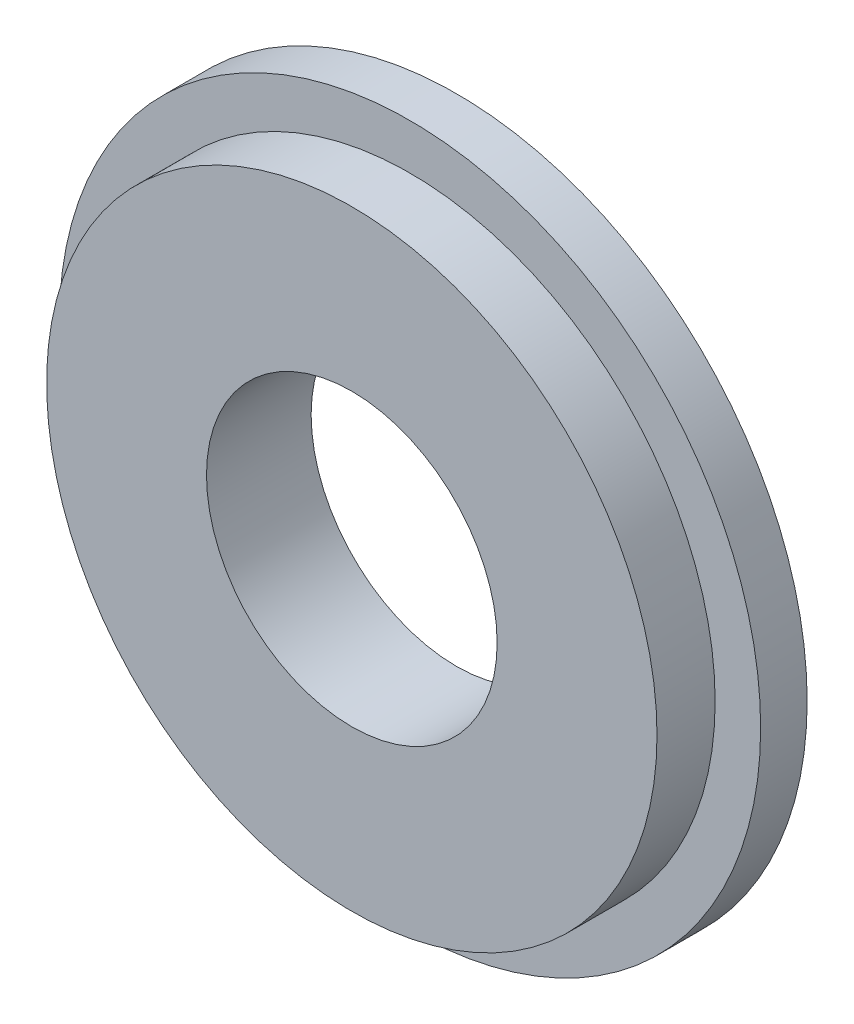
ISO-10303-21;
HEADER;
FILE_DESCRIPTION(('STEP AP214'),'2;1');
FILE_NAME('part.step','',(''),(''),'','','');
FILE_SCHEMA(('AUTOMOTIVE_DESIGN { 1 0 10303 214 1 1 1 1 }'));
ENDSEC;
DATA;
#1=APPLICATION_CONTEXT('core data for automotive mechanical design processes');
#2=APPLICATION_PROTOCOL_DEFINITION('international standard','automotive_design',2000,#1);
#3=PRODUCT_CONTEXT('',#1,'mechanical');
#4=PRODUCT('Part','Part','',(#3));
#5=PRODUCT_RELATED_PRODUCT_CATEGORY('part','',(#4));
#6=PRODUCT_DEFINITION_FORMATION('','',#4);
#7=PRODUCT_DEFINITION_CONTEXT('part definition',#1,'design');
#8=PRODUCT_DEFINITION('design','',#6,#7);
#9=PRODUCT_DEFINITION_SHAPE('','',#8);
#10=(LENGTH_UNIT() NAMED_UNIT(*) SI_UNIT(.MILLI.,.METRE.));
#11=(NAMED_UNIT(*) PLANE_ANGLE_UNIT() SI_UNIT($,.RADIAN.));
#12=(NAMED_UNIT(*) SI_UNIT($,.STERADIAN.) SOLID_ANGLE_UNIT());
#13=UNCERTAINTY_MEASURE_WITH_UNIT(LENGTH_MEASURE(1.E-05),#10,'distance_accuracy_value','');
#14=(GEOMETRIC_REPRESENTATION_CONTEXT(3) GLOBAL_UNCERTAINTY_ASSIGNED_CONTEXT((#13)) GLOBAL_UNIT_ASSIGNED_CONTEXT((#10,
#11,#12)) REPRESENTATION_CONTEXT('',''));
#15=CARTESIAN_POINT('',(0.,0.,0.));
#16=DIRECTION('',(0.,0.,1.));
#17=DIRECTION('',(1.,0.,0.));
#18=AXIS2_PLACEMENT_3D('',#15,#16,#17);
#19=CARTESIAN_POINT('',(0.,0.,4.));
#20=DIRECTION('',(0.,0.,1.));
#21=DIRECTION('',(1.,0.,0.));
#22=AXIS2_PLACEMENT_3D('',#19,#20,#21);
#23=PLANE('',#22);
#24=CARTESIAN_POINT('',(0.,0.,4.));
#25=DIRECTION('',(0.,0.,1.));
#26=DIRECTION('',(1.,0.,0.));
#27=AXIS2_PLACEMENT_3D('',#24,#25,#26);
#28=CIRCLE('',#27,26.25);
#29=CARTESIAN_POINT('',(26.25,0.,4.));
#30=VERTEX_POINT('',#29);
#31=EDGE_CURVE('E10',#30,#30,#28,.T.);
#32=ORIENTED_EDGE('',*,*,#31,.F.);
#33=EDGE_LOOP('',(#32));
#34=FACE_BOUND('',#33,.T.);
#35=CARTESIAN_POINT('',(0.,0.,4.));
#36=DIRECTION('',(0.,0.,1.));
#37=DIRECTION('',(1.,0.,0.));
#38=AXIS2_PLACEMENT_3D('',#35,#36,#37);
#39=CIRCLE('',#38,30.165);
#40=CARTESIAN_POINT('',(30.165,0.,4.));
#41=VERTEX_POINT('',#40);
#42=EDGE_CURVE('E44',#41,#41,#39,.T.);
#43=ORIENTED_EDGE('',*,*,#42,.T.);
#44=EDGE_LOOP('',(#43));
#45=FACE_BOUND('',#44,.T.);
#46=ADVANCED_FACE('F36',(#34,#45),#23,.T.);
#47=CARTESIAN_POINT('',(0.,0.,0.));
#48=DIRECTION('',(0.,0.,1.));
#49=DIRECTION('',(1.,0.,0.));
#50=AXIS2_PLACEMENT_3D('',#47,#48,#49);
#51=PLANE('',#50);
#52=CARTESIAN_POINT('',(0.,20.,0.));
#53=DIRECTION('',(0.,0.,-1.));
#54=DIRECTION('',(-1.,0.,0.));
#55=AXIS2_PLACEMENT_3D('',#52,#53,#54);
#56=CIRCLE('',#55,1.5);
#57=CARTESIAN_POINT('',(-1.5,20.,0.));
#58=VERTEX_POINT('',#57);
#59=EDGE_CURVE('E67',#58,#58,#56,.T.);
#60=ORIENTED_EDGE('',*,*,#59,.F.);
#61=EDGE_LOOP('',(#60));
#62=FACE_BOUND('',#61,.T.);
#63=CARTESIAN_POINT('',(0.,-20.,0.));
#64=DIRECTION('',(0.,0.,-1.));
#65=DIRECTION('',(-1.,0.,0.));
#66=AXIS2_PLACEMENT_3D('',#63,#64,#65);
#67=CIRCLE('',#66,1.63668113245599);
#68=CARTESIAN_POINT('',(-1.63668113245599,-20.,0.));
#69=VERTEX_POINT('',#68);
#70=EDGE_CURVE('E82',#69,#69,#67,.T.);
#71=ORIENTED_EDGE('',*,*,#70,.F.);
#72=EDGE_LOOP('',(#71));
#73=FACE_BOUND('',#72,.T.);
#74=CARTESIAN_POINT('',(-20.,0.,0.));
#75=DIRECTION('',(0.,0.,-1.));
#76=DIRECTION('',(-1.,0.,0.));
#77=AXIS2_PLACEMENT_3D('',#74,#75,#76);
#78=CIRCLE('',#77,1.5);
#79=CARTESIAN_POINT('',(-21.5,0.,0.));
#80=VERTEX_POINT('',#79);
#81=EDGE_CURVE('E76',#80,#80,#78,.T.);
#82=ORIENTED_EDGE('',*,*,#81,.F.);
#83=EDGE_LOOP('',(#82));
#84=FACE_BOUND('',#83,.T.);
#85=CARTESIAN_POINT('',(20.,0.,0.));
#86=DIRECTION('',(0.,0.,-1.));
#87=DIRECTION('',(-1.,0.,0.));
#88=AXIS2_PLACEMENT_3D('',#85,#86,#87);
#89=CIRCLE('',#88,1.5);
#90=CARTESIAN_POINT('',(18.5,0.,0.));
#91=VERTEX_POINT('',#90);
#92=EDGE_CURVE('E70',#91,#91,#89,.T.);
#93=ORIENTED_EDGE('',*,*,#92,.F.);
#94=EDGE_LOOP('',(#93));
#95=FACE_BOUND('',#94,.T.);
#96=CARTESIAN_POINT('',(0.,0.,0.));
#97=DIRECTION('',(0.,0.,1.));
#98=DIRECTION('',(1.,0.,0.));
#99=AXIS2_PLACEMENT_3D('',#96,#97,#98);
#100=CIRCLE('',#99,30.165);
#101=CARTESIAN_POINT('',(30.165,0.,0.));
#102=VERTEX_POINT('',#101);
#103=EDGE_CURVE('E40',#102,#102,#100,.T.);
#104=ORIENTED_EDGE('',*,*,#103,.F.);
#105=EDGE_LOOP('',(#104));
#106=FACE_BOUND('',#105,.T.);
#107=CARTESIAN_POINT('',(0.,0.,0.));
#108=DIRECTION('',(0.,0.,1.));
#109=DIRECTION('',(1.,0.,0.));
#110=AXIS2_PLACEMENT_3D('',#107,#108,#109);
#111=CIRCLE('',#110,12.5);
#112=CARTESIAN_POINT('',(12.5,0.,0.));
#113=VERTEX_POINT('',#112);
#114=EDGE_CURVE('E53',#113,#113,#111,.T.);
#115=ORIENTED_EDGE('',*,*,#114,.T.);
#116=EDGE_LOOP('',(#115));
#117=FACE_BOUND('',#116,.T.);
#118=ADVANCED_FACE('F93',(#62,#73,#84,#95,#106,#117),#51,.F.);
#119=CARTESIAN_POINT('',(0.,0.,4.));
#120=DIRECTION('',(0.,0.,-1.));
#121=DIRECTION('',(-1.,0.,0.));
#122=AXIS2_PLACEMENT_3D('',#119,#120,#121);
#123=CYLINDRICAL_SURFACE('',#122,30.165);
#124=ORIENTED_EDGE('',*,*,#42,.F.);
#125=EDGE_LOOP('',(#124));
#126=FACE_BOUND('',#125,.T.);
#127=ORIENTED_EDGE('',*,*,#103,.T.);
#128=EDGE_LOOP('',(#127));
#129=FACE_BOUND('',#128,.T.);
#130=ADVANCED_FACE('F38',(#126,#129),#123,.T.);
#131=CARTESIAN_POINT('',(0.,0.,4.));
#132=DIRECTION('',(0.,0.,-1.));
#133=DIRECTION('',(-1.,0.,0.));
#134=AXIS2_PLACEMENT_3D('',#131,#132,#133);
#135=CYLINDRICAL_SURFACE('',#134,12.5);
#136=ORIENTED_EDGE('',*,*,#114,.F.);
#137=EDGE_LOOP('',(#136));
#138=FACE_BOUND('',#137,.T.);
#139=CARTESIAN_POINT('',(0.,0.,9.));
#140=DIRECTION('',(0.,0.,1.));
#141=DIRECTION('',(1.,0.,0.));
#142=AXIS2_PLACEMENT_3D('',#139,#140,#141);
#143=CIRCLE('',#142,12.5);
#144=CARTESIAN_POINT('',(12.5,0.,9.));
#145=VERTEX_POINT('',#144);
#146=EDGE_CURVE('E59',#145,#145,#143,.T.);
#147=ORIENTED_EDGE('',*,*,#146,.T.);
#148=EDGE_LOOP('',(#147));
#149=FACE_BOUND('',#148,.T.);
#150=ADVANCED_FACE('F105',(#138,#149),#135,.F.);
#151=CARTESIAN_POINT('',(0.,0.,9.));
#152=DIRECTION('',(0.,0.,1.));
#153=DIRECTION('',(1.,0.,0.));
#154=AXIS2_PLACEMENT_3D('',#151,#152,#153);
#155=PLANE('',#154);
#156=CARTESIAN_POINT('',(0.,0.,9.));
#157=DIRECTION('',(0.,0.,1.));
#158=DIRECTION('',(1.,0.,0.));
#159=AXIS2_PLACEMENT_3D('',#156,#157,#158);
#160=CIRCLE('',#159,26.25);
#161=CARTESIAN_POINT('',(26.25,0.,9.));
#162=VERTEX_POINT('',#161);
#163=EDGE_CURVE('E51',#162,#162,#160,.T.);
#164=ORIENTED_EDGE('',*,*,#163,.T.);
#165=EDGE_LOOP('',(#164));
#166=FACE_BOUND('',#165,.T.);
#167=ORIENTED_EDGE('',*,*,#146,.F.);
#168=EDGE_LOOP('',(#167));
#169=FACE_BOUND('',#168,.T.);
#170=ADVANCED_FACE('F111',(#166,#169),#155,.T.);
#171=CARTESIAN_POINT('',(0.,0.,9.));
#172=DIRECTION('',(0.,0.,-1.));
#173=DIRECTION('',(-1.,0.,0.));
#174=AXIS2_PLACEMENT_3D('',#171,#172,#173);
#175=CYLINDRICAL_SURFACE('',#174,26.25);
#176=ORIENTED_EDGE('',*,*,#163,.F.);
#177=EDGE_LOOP('',(#176));
#178=FACE_BOUND('',#177,.T.);
#179=ORIENTED_EDGE('',*,*,#31,.T.);
#180=EDGE_LOOP('',(#179));
#181=FACE_BOUND('',#180,.T.);
#182=ADVANCED_FACE('F122',(#178,#181),#175,.T.);
#183=CARTESIAN_POINT('',(20.,0.,5.));
#184=DIRECTION('',(0.,0.,-1.));
#185=DIRECTION('',(-1.,0.,0.));
#186=AXIS2_PLACEMENT_3D('',#183,#184,#185);
#187=CYLINDRICAL_SURFACE('',#186,1.5);
#188=CARTESIAN_POINT('',(20.,0.,5.));
#189=DIRECTION('',(0.,0.,-1.));
#190=DIRECTION('',(-1.,0.,0.));
#191=AXIS2_PLACEMENT_3D('',#188,#189,#190);
#192=CIRCLE('',#191,1.5);
#193=CARTESIAN_POINT('',(18.5,0.,5.));
#194=VERTEX_POINT('',#193);
#195=EDGE_CURVE('E73',#194,#194,#192,.T.);
#196=ORIENTED_EDGE('',*,*,#195,.F.);
#197=EDGE_LOOP('',(#196));
#198=FACE_BOUND('',#197,.T.);
#199=ORIENTED_EDGE('',*,*,#92,.T.);
#200=EDGE_LOOP('',(#199));
#201=FACE_BOUND('',#200,.T.);
#202=ADVANCED_FACE('F125',(#198,#201),#187,.F.);
#203=CARTESIAN_POINT('',(20.,0.,5.));
#204=DIRECTION('',(0.,0.,-1.));
#205=DIRECTION('',(-1.,0.,0.));
#206=AXIS2_PLACEMENT_3D('',#203,#204,#205);
#207=PLANE('',#206);
#208=ORIENTED_EDGE('',*,*,#195,.T.);
#209=EDGE_LOOP('',(#208));
#210=FACE_BOUND('',#209,.T.);
#211=ADVANCED_FACE('F131',(#210),#207,.T.);
#212=CARTESIAN_POINT('',(-20.,0.,5.));
#213=DIRECTION('',(0.,0.,-1.));
#214=DIRECTION('',(-1.,0.,0.));
#215=AXIS2_PLACEMENT_3D('',#212,#213,#214);
#216=CYLINDRICAL_SURFACE('',#215,1.5);
#217=CARTESIAN_POINT('',(-20.,0.,5.));
#218=DIRECTION('',(0.,0.,-1.));
#219=DIRECTION('',(-1.,0.,0.));
#220=AXIS2_PLACEMENT_3D('',#217,#218,#219);
#221=CIRCLE('',#220,1.5);
#222=CARTESIAN_POINT('',(-21.5,0.,5.));
#223=VERTEX_POINT('',#222);
#224=EDGE_CURVE('E79',#223,#223,#221,.T.);
#225=ORIENTED_EDGE('',*,*,#224,.F.);
#226=EDGE_LOOP('',(#225));
#227=FACE_BOUND('',#226,.T.);
#228=ORIENTED_EDGE('',*,*,#81,.T.);
#229=EDGE_LOOP('',(#228));
#230=FACE_BOUND('',#229,.T.);
#231=ADVANCED_FACE('F135',(#227,#230),#216,.F.);
#232=CARTESIAN_POINT('',(-20.,0.,5.));
#233=DIRECTION('',(0.,0.,-1.));
#234=DIRECTION('',(-1.,0.,0.));
#235=AXIS2_PLACEMENT_3D('',#232,#233,#234);
#236=PLANE('',#235);
#237=ORIENTED_EDGE('',*,*,#224,.T.);
#238=EDGE_LOOP('',(#237));
#239=FACE_BOUND('',#238,.T.);
#240=ADVANCED_FACE('F139',(#239),#236,.T.);
#241=CARTESIAN_POINT('',(0.,-20.,5.));
#242=DIRECTION('',(0.,0.,-1.));
#243=DIRECTION('',(-1.,0.,0.));
#244=AXIS2_PLACEMENT_3D('',#241,#242,#243);
#245=CYLINDRICAL_SURFACE('',#244,1.63668113245599);
#246=CARTESIAN_POINT('',(0.,-20.,5.));
#247=DIRECTION('',(0.,0.,-1.));
#248=DIRECTION('',(-1.,0.,0.));
#249=AXIS2_PLACEMENT_3D('',#246,#247,#248);
#250=CIRCLE('',#249,1.63668113245599);
#251=CARTESIAN_POINT('',(-1.63668113245599,-20.,5.));
#252=VERTEX_POINT('',#251);
#253=EDGE_CURVE('E85',#252,#252,#250,.T.);
#254=ORIENTED_EDGE('',*,*,#253,.F.);
#255=EDGE_LOOP('',(#254));
#256=FACE_BOUND('',#255,.T.);
#257=ORIENTED_EDGE('',*,*,#70,.T.);
#258=EDGE_LOOP('',(#257));
#259=FACE_BOUND('',#258,.T.);
#260=ADVANCED_FACE('F143',(#256,#259),#245,.F.);
#261=CARTESIAN_POINT('',(0.,-20.,5.));
#262=DIRECTION('',(0.,0.,-1.));
#263=DIRECTION('',(-1.,0.,0.));
#264=AXIS2_PLACEMENT_3D('',#261,#262,#263);
#265=PLANE('',#264);
#266=ORIENTED_EDGE('',*,*,#253,.T.);
#267=EDGE_LOOP('',(#266));
#268=FACE_BOUND('',#267,.T.);
#269=ADVANCED_FACE('F147',(#268),#265,.T.);
#270=CARTESIAN_POINT('',(0.,20.,5.));
#271=DIRECTION('',(0.,0.,-1.));
#272=DIRECTION('',(-1.,0.,0.));
#273=AXIS2_PLACEMENT_3D('',#270,#271,#272);
#274=CYLINDRICAL_SURFACE('',#273,1.5);
#275=CARTESIAN_POINT('',(0.,20.,5.));
#276=DIRECTION('',(0.,0.,-1.));
#277=DIRECTION('',(-1.,0.,0.));
#278=AXIS2_PLACEMENT_3D('',#275,#276,#277);
#279=CIRCLE('',#278,1.5);
#280=CARTESIAN_POINT('',(-1.5,20.,5.));
#281=VERTEX_POINT('',#280);
#282=EDGE_CURVE('E63',#281,#281,#279,.T.);
#283=ORIENTED_EDGE('',*,*,#282,.F.);
#284=EDGE_LOOP('',(#283));
#285=FACE_BOUND('',#284,.T.);
#286=ORIENTED_EDGE('',*,*,#59,.T.);
#287=EDGE_LOOP('',(#286));
#288=FACE_BOUND('',#287,.T.);
#289=ADVANCED_FACE('F91',(#285,#288),#274,.F.);
#290=CARTESIAN_POINT('',(0.,20.,5.));
#291=DIRECTION('',(0.,0.,-1.));
#292=DIRECTION('',(-1.,0.,0.));
#293=AXIS2_PLACEMENT_3D('',#290,#291,#292);
#294=PLANE('',#293);
#295=ORIENTED_EDGE('',*,*,#282,.T.);
#296=EDGE_LOOP('',(#295));
#297=FACE_BOUND('',#296,.T.);
#298=ADVANCED_FACE('F154',(#297),#294,.T.);
#299=CLOSED_SHELL('',(#46,#118,#130,#150,#170,#182,#202,#211,#231,#240,#260,#269,#289,#298));
#300=MANIFOLD_SOLID_BREP('B2',#299);
#301=ADVANCED_BREP_SHAPE_REPRESENTATION('',(#18,#300),#14);
#302=SHAPE_DEFINITION_REPRESENTATION(#9,#301);
ENDSEC;
END-ISO-10303-21;
